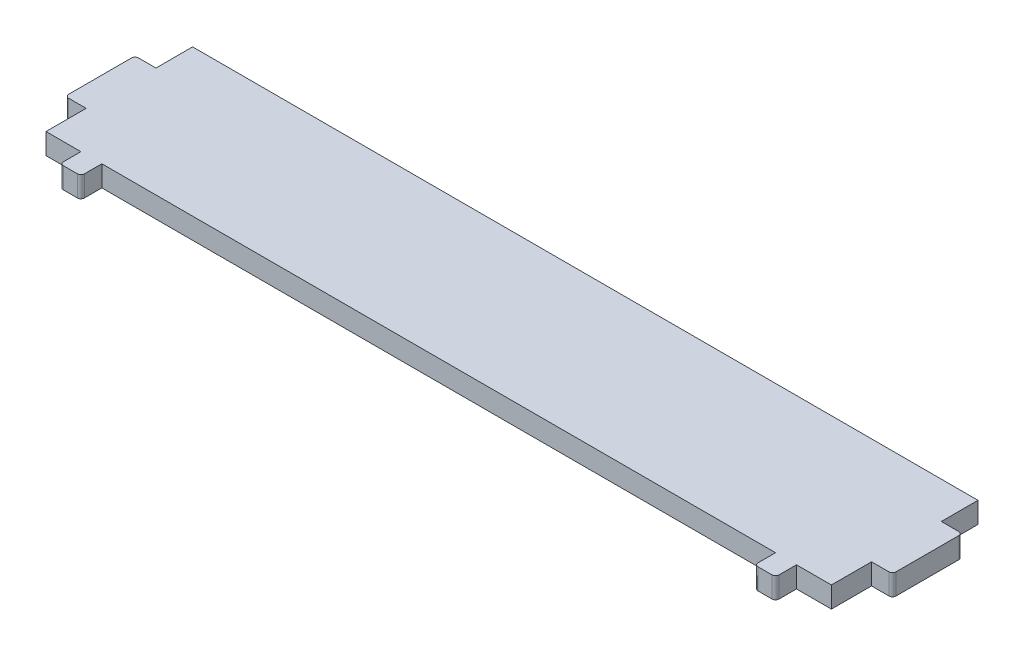
ISO-10303-21;
HEADER;
FILE_DESCRIPTION(('STEP AP214'),'2;1');
FILE_NAME('part.step','',(''),(''),'','','');
FILE_SCHEMA(('AUTOMOTIVE_DESIGN { 1 0 10303 214 1 1 1 1 }'));
ENDSEC;
DATA;
#1=APPLICATION_CONTEXT('core data for automotive mechanical design processes');
#2=APPLICATION_PROTOCOL_DEFINITION('international standard','automotive_design',2000,#1);
#3=PRODUCT_CONTEXT('',#1,'mechanical');
#4=PRODUCT('Part','Part','',(#3));
#5=PRODUCT_RELATED_PRODUCT_CATEGORY('part','',(#4));
#6=PRODUCT_DEFINITION_FORMATION('','',#4);
#7=PRODUCT_DEFINITION_CONTEXT('part definition',#1,'design');
#8=PRODUCT_DEFINITION('design','',#6,#7);
#9=PRODUCT_DEFINITION_SHAPE('','',#8);
#10=(LENGTH_UNIT() NAMED_UNIT(*) SI_UNIT(.MILLI.,.METRE.));
#11=(NAMED_UNIT(*) PLANE_ANGLE_UNIT() SI_UNIT($,.RADIAN.));
#12=(NAMED_UNIT(*) SI_UNIT($,.STERADIAN.) SOLID_ANGLE_UNIT());
#13=UNCERTAINTY_MEASURE_WITH_UNIT(LENGTH_MEASURE(1.E-05),#10,'distance_accuracy_value','');
#14=(GEOMETRIC_REPRESENTATION_CONTEXT(3) GLOBAL_UNCERTAINTY_ASSIGNED_CONTEXT((#13)) GLOBAL_UNIT_ASSIGNED_CONTEXT((#10,
#11,#12)) REPRESENTATION_CONTEXT('',''));
#15=CARTESIAN_POINT('',(0.,0.,0.));
#16=DIRECTION('',(0.,0.,1.));
#17=DIRECTION('',(1.,0.,0.));
#18=AXIS2_PLACEMENT_3D('',#15,#16,#17);
#19=CARTESIAN_POINT('',(-56.25,3.,0.));
#20=DIRECTION('',(-1.,0.,0.));
#21=DIRECTION('',(0.,0.,1.));
#22=AXIS2_PLACEMENT_3D('',#19,#20,#21);
#23=PLANE('',#22);
#24=DIRECTION('',(0.,0.,-1.));
#25=VECTOR('',#24,1.);
#26=CARTESIAN_POINT('',(-56.25,0.,0.));
#27=LINE('',#26,#25);
#28=CARTESIAN_POINT('',(-56.25,0.,21.));
#29=VERTEX_POINT('',#28);
#30=CARTESIAN_POINT('',(-56.25,0.,15.25));
#31=VERTEX_POINT('',#30);
#32=EDGE_CURVE('E232',#29,#31,#27,.T.);
#33=ORIENTED_EDGE('',*,*,#32,.F.);
#34=DIRECTION('',(0.,-1.,0.));
#35=VECTOR('',#34,1.);
#36=CARTESIAN_POINT('',(-56.25,3.,21.));
#37=LINE('',#36,#35);
#38=CARTESIAN_POINT('',(-56.25,3.,21.));
#39=VERTEX_POINT('',#38);
#40=EDGE_CURVE('E227',#39,#29,#37,.T.);
#41=ORIENTED_EDGE('',*,*,#40,.F.);
#42=DIRECTION('',(0.,0.,-1.));
#43=VECTOR('',#42,1.);
#44=CARTESIAN_POINT('',(-56.25,3.,0.));
#45=LINE('',#44,#43);
#46=CARTESIAN_POINT('',(-56.25,3.,15.25));
#47=VERTEX_POINT('',#46);
#48=EDGE_CURVE('E230',#39,#47,#45,.T.);
#49=ORIENTED_EDGE('',*,*,#48,.T.);
#50=DIRECTION('',(0.,-1.,0.));
#51=VECTOR('',#50,1.);
#52=CARTESIAN_POINT('',(-56.25,3.,15.25));
#53=LINE('',#52,#51);
#54=EDGE_CURVE('E292',#47,#31,#53,.T.);
#55=ORIENTED_EDGE('',*,*,#54,.T.);
#56=EDGE_LOOP('',(#33,#41,#49,#55));
#57=FACE_BOUND('',#56,.T.);
#58=ADVANCED_FACE('F41',(#57),#23,.T.);
#59=CARTESIAN_POINT('',(0.,3.,21.));
#60=DIRECTION('',(0.,0.,-1.));
#61=DIRECTION('',(-1.,0.,0.));
#62=AXIS2_PLACEMENT_3D('',#59,#60,#61);
#63=PLANE('',#62);
#64=DIRECTION('',(1.,0.,0.));
#65=VECTOR('',#64,1.);
#66=CARTESIAN_POINT('',(0.,0.,21.));
#67=LINE('',#66,#65);
#68=CARTESIAN_POINT('',(-51.25,0.,21.));
#69=VERTEX_POINT('',#68);
#70=EDGE_CURVE('E294',#29,#69,#67,.T.);
#71=ORIENTED_EDGE('',*,*,#70,.T.);
#72=DIRECTION('',(0.,-1.,0.));
#73=VECTOR('',#72,1.);
#74=CARTESIAN_POINT('',(-51.25,3.,21.));
#75=LINE('',#74,#73);
#76=CARTESIAN_POINT('',(-51.25,3.,21.));
#77=VERTEX_POINT('',#76);
#78=EDGE_CURVE('E237',#77,#69,#75,.T.);
#79=ORIENTED_EDGE('',*,*,#78,.F.);
#80=DIRECTION('',(1.,0.,0.));
#81=VECTOR('',#80,1.);
#82=CARTESIAN_POINT('',(0.,3.,21.));
#83=LINE('',#82,#81);
#84=EDGE_CURVE('E241',#39,#77,#83,.T.);
#85=ORIENTED_EDGE('',*,*,#84,.F.);
#86=ORIENTED_EDGE('',*,*,#40,.T.);
#87=EDGE_LOOP('',(#71,#79,#85,#86));
#88=FACE_BOUND('',#87,.T.);
#89=ADVANCED_FACE('F242',(#88),#63,.F.);
#90=CARTESIAN_POINT('',(-51.25,3.,0.));
#91=DIRECTION('',(-1.,0.,0.));
#92=DIRECTION('',(0.,0.,1.));
#93=AXIS2_PLACEMENT_3D('',#90,#91,#92);
#94=PLANE('',#93);
#95=DIRECTION('',(0.,0.,-1.));
#96=VECTOR('',#95,1.);
#97=CARTESIAN_POINT('',(-51.25,0.,0.));
#98=LINE('',#97,#96);
#99=CARTESIAN_POINT('',(-51.25,0.,23.5));
#100=VERTEX_POINT('',#99);
#101=EDGE_CURVE('E296',#100,#69,#98,.T.);
#102=ORIENTED_EDGE('',*,*,#101,.F.);
#103=DIRECTION('',(0.,-1.,0.));
#104=VECTOR('',#103,1.);
#105=CARTESIAN_POINT('',(-51.25,3.,23.5));
#106=LINE('',#105,#104);
#107=CARTESIAN_POINT('',(-51.25,3.,23.5));
#108=VERTEX_POINT('',#107);
#109=EDGE_CURVE('E382',#100,#108,#106,.F.);
#110=ORIENTED_EDGE('',*,*,#109,.T.);
#111=DIRECTION('',(0.,0.,-1.));
#112=VECTOR('',#111,1.);
#113=CARTESIAN_POINT('',(-51.25,3.,0.));
#114=LINE('',#113,#112);
#115=EDGE_CURVE('E245',#108,#77,#114,.T.);
#116=ORIENTED_EDGE('',*,*,#115,.T.);
#117=ORIENTED_EDGE('',*,*,#78,.T.);
#118=EDGE_LOOP('',(#102,#110,#116,#117));
#119=FACE_BOUND('',#118,.T.);
#120=ADVANCED_FACE('F479',(#119),#94,.T.);
#121=CARTESIAN_POINT('',(0.,3.,24.));
#122=DIRECTION('',(0.,0.,1.));
#123=DIRECTION('',(1.,0.,0.));
#124=AXIS2_PLACEMENT_3D('',#121,#122,#123);
#125=PLANE('',#124);
#126=DIRECTION('',(-1.,0.,0.));
#127=VECTOR('',#126,1.);
#128=CARTESIAN_POINT('',(0.,3.,24.));
#129=LINE('',#128,#127);
#130=CARTESIAN_POINT('',(-48.75,3.,24.));
#131=VERTEX_POINT('',#130);
#132=CARTESIAN_POINT('',(-50.75,3.,24.));
#133=VERTEX_POINT('',#132);
#134=EDGE_CURVE('E258',#131,#133,#129,.T.);
#135=ORIENTED_EDGE('',*,*,#134,.T.);
#136=DIRECTION('',(0.,-1.,0.));
#137=VECTOR('',#136,1.);
#138=CARTESIAN_POINT('',(-50.75,3.,24.));
#139=LINE('',#138,#137);
#140=CARTESIAN_POINT('',(-50.75,0.,24.));
#141=VERTEX_POINT('',#140);
#142=EDGE_CURVE('E363',#133,#141,#139,.T.);
#143=ORIENTED_EDGE('',*,*,#142,.T.);
#144=DIRECTION('',(-1.,0.,0.));
#145=VECTOR('',#144,1.);
#146=CARTESIAN_POINT('',(0.,0.,24.));
#147=LINE('',#146,#145);
#148=CARTESIAN_POINT('',(-48.75,0.,24.));
#149=VERTEX_POINT('',#148);
#150=EDGE_CURVE('E300',#149,#141,#147,.T.);
#151=ORIENTED_EDGE('',*,*,#150,.F.);
#152=DIRECTION('',(0.,-1.,0.));
#153=VECTOR('',#152,1.);
#154=CARTESIAN_POINT('',(-48.75,3.,24.));
#155=LINE('',#154,#153);
#156=EDGE_CURVE('E236',#149,#131,#155,.F.);
#157=ORIENTED_EDGE('',*,*,#156,.T.);
#158=EDGE_LOOP('',(#135,#143,#151,#157));
#159=FACE_BOUND('',#158,.T.);
#160=ADVANCED_FACE('F487',(#159),#125,.T.);
#161=CARTESIAN_POINT('',(-48.25,3.,0.));
#162=DIRECTION('',(-1.,0.,0.));
#163=DIRECTION('',(0.,0.,1.));
#164=AXIS2_PLACEMENT_3D('',#161,#162,#163);
#165=PLANE('',#164);
#166=DIRECTION('',(0.,0.,-1.));
#167=VECTOR('',#166,1.);
#168=CARTESIAN_POINT('',(-48.25,3.,0.));
#169=LINE('',#168,#167);
#170=CARTESIAN_POINT('',(-48.25,3.,23.5));
#171=VERTEX_POINT('',#170);
#172=CARTESIAN_POINT('',(-48.25,3.,21.));
#173=VERTEX_POINT('',#172);
#174=EDGE_CURVE('E261',#171,#173,#169,.T.);
#175=ORIENTED_EDGE('',*,*,#174,.F.);
#176=DIRECTION('',(0.,-1.,0.));
#177=VECTOR('',#176,1.);
#178=CARTESIAN_POINT('',(-48.25,0.,23.5));
#179=LINE('',#178,#177);
#180=CARTESIAN_POINT('',(-48.25,0.,23.5));
#181=VERTEX_POINT('',#180);
#182=EDGE_CURVE('E398',#171,#181,#179,.T.);
#183=ORIENTED_EDGE('',*,*,#182,.T.);
#184=DIRECTION('',(0.,0.,-1.));
#185=VECTOR('',#184,1.);
#186=CARTESIAN_POINT('',(-48.25,0.,0.));
#187=LINE('',#186,#185);
#188=CARTESIAN_POINT('',(-48.25,0.,21.));
#189=VERTEX_POINT('',#188);
#190=EDGE_CURVE('E303',#181,#189,#187,.T.);
#191=ORIENTED_EDGE('',*,*,#190,.T.);
#192=DIRECTION('',(0.,-1.,0.));
#193=VECTOR('',#192,1.);
#194=CARTESIAN_POINT('',(-48.25,3.,21.));
#195=LINE('',#194,#193);
#196=EDGE_CURVE('E358',#173,#189,#195,.T.);
#197=ORIENTED_EDGE('',*,*,#196,.F.);
#198=EDGE_LOOP('',(#175,#183,#191,#197));
#199=FACE_BOUND('',#198,.T.);
#200=ADVANCED_FACE('F497',(#199),#165,.F.);
#201=CARTESIAN_POINT('',(48.25,0.,21.));
#202=VERTEX_POINT('',#201);
#203=EDGE_CURVE('E298',#189,#202,#67,.T.);
#204=ORIENTED_EDGE('',*,*,#203,.T.);
#205=DIRECTION('',(0.,-1.,0.));
#206=VECTOR('',#205,1.);
#207=CARTESIAN_POINT('',(48.25,3.,21.));
#208=LINE('',#207,#206);
#209=CARTESIAN_POINT('',(48.25,3.,21.));
#210=VERTEX_POINT('',#209);
#211=EDGE_CURVE('E355',#210,#202,#208,.T.);
#212=ORIENTED_EDGE('',*,*,#211,.F.);
#213=EDGE_CURVE('E248',#173,#210,#83,.T.);
#214=ORIENTED_EDGE('',*,*,#213,.F.);
#215=ORIENTED_EDGE('',*,*,#196,.T.);
#216=EDGE_LOOP('',(#204,#212,#214,#215));
#217=FACE_BOUND('',#216,.T.);
#218=ADVANCED_FACE('F506',(#217),#63,.F.);
#219=CARTESIAN_POINT('',(48.25,3.,0.));
#220=DIRECTION('',(-1.,0.,0.));
#221=DIRECTION('',(0.,0.,1.));
#222=AXIS2_PLACEMENT_3D('',#219,#220,#221);
#223=PLANE('',#222);
#224=DIRECTION('',(0.,0.,-1.));
#225=VECTOR('',#224,1.);
#226=CARTESIAN_POINT('',(48.25,0.,0.));
#227=LINE('',#226,#225);
#228=CARTESIAN_POINT('',(48.25,0.,23.5));
#229=VERTEX_POINT('',#228);
#230=EDGE_CURVE('E305',#229,#202,#227,.T.);
#231=ORIENTED_EDGE('',*,*,#230,.F.);
#232=DIRECTION('',(0.,-1.,0.));
#233=VECTOR('',#232,1.);
#234=CARTESIAN_POINT('',(48.25,3.,23.5));
#235=LINE('',#234,#233);
#236=CARTESIAN_POINT('',(48.25,3.,23.5));
#237=VERTEX_POINT('',#236);
#238=EDGE_CURVE('E406',#229,#237,#235,.F.);
#239=ORIENTED_EDGE('',*,*,#238,.T.);
#240=DIRECTION('',(0.,0.,-1.));
#241=VECTOR('',#240,1.);
#242=CARTESIAN_POINT('',(48.25,3.,0.));
#243=LINE('',#242,#241);
#244=EDGE_CURVE('E263',#237,#210,#243,.T.);
#245=ORIENTED_EDGE('',*,*,#244,.T.);
#246=ORIENTED_EDGE('',*,*,#211,.T.);
#247=EDGE_LOOP('',(#231,#239,#245,#246));
#248=FACE_BOUND('',#247,.T.);
#249=ADVANCED_FACE('F509',(#248),#223,.T.);
#250=CARTESIAN_POINT('',(0.,3.,24.));
#251=DIRECTION('',(0.,0.,-1.));
#252=DIRECTION('',(-1.,0.,0.));
#253=AXIS2_PLACEMENT_3D('',#250,#251,#252);
#254=PLANE('',#253);
#255=DIRECTION('',(1.,0.,0.));
#256=VECTOR('',#255,1.);
#257=CARTESIAN_POINT('',(0.,3.,24.));
#258=LINE('',#257,#256);
#259=CARTESIAN_POINT('',(48.75,3.,24.));
#260=VERTEX_POINT('',#259);
#261=CARTESIAN_POINT('',(50.75,3.,24.));
#262=VERTEX_POINT('',#261);
#263=EDGE_CURVE('E265',#260,#262,#258,.T.);
#264=ORIENTED_EDGE('',*,*,#263,.F.);
#265=DIRECTION('',(0.,-1.,0.));
#266=VECTOR('',#265,1.);
#267=CARTESIAN_POINT('',(48.75,0.,24.));
#268=LINE('',#267,#266);
#269=CARTESIAN_POINT('',(48.75,0.,24.));
#270=VERTEX_POINT('',#269);
#271=EDGE_CURVE('E403',#260,#270,#268,.T.);
#272=ORIENTED_EDGE('',*,*,#271,.T.);
#273=DIRECTION('',(1.,0.,0.));
#274=VECTOR('',#273,1.);
#275=CARTESIAN_POINT('',(0.,0.,24.));
#276=LINE('',#275,#274);
#277=CARTESIAN_POINT('',(50.75,0.,24.));
#278=VERTEX_POINT('',#277);
#279=EDGE_CURVE('E307',#270,#278,#276,.T.);
#280=ORIENTED_EDGE('',*,*,#279,.T.);
#281=DIRECTION('',(0.,-1.,0.));
#282=VECTOR('',#281,1.);
#283=CARTESIAN_POINT('',(50.75,3.,24.));
#284=LINE('',#283,#282);
#285=EDGE_CURVE('E401',#278,#262,#284,.F.);
#286=ORIENTED_EDGE('',*,*,#285,.T.);
#287=EDGE_LOOP('',(#264,#272,#280,#286));
#288=FACE_BOUND('',#287,.T.);
#289=ADVANCED_FACE('F517',(#288),#254,.F.);
#290=CARTESIAN_POINT('',(51.25,3.,0.));
#291=DIRECTION('',(-1.,0.,0.));
#292=DIRECTION('',(0.,0.,1.));
#293=AXIS2_PLACEMENT_3D('',#290,#291,#292);
#294=PLANE('',#293);
#295=DIRECTION('',(0.,0.,-1.));
#296=VECTOR('',#295,1.);
#297=CARTESIAN_POINT('',(51.25,3.,0.));
#298=LINE('',#297,#296);
#299=CARTESIAN_POINT('',(51.25,3.,23.5));
#300=VERTEX_POINT('',#299);
#301=CARTESIAN_POINT('',(51.25,3.,21.));
#302=VERTEX_POINT('',#301);
#303=EDGE_CURVE('E268',#300,#302,#298,.T.);
#304=ORIENTED_EDGE('',*,*,#303,.F.);
#305=DIRECTION('',(0.,-1.,0.));
#306=VECTOR('',#305,1.);
#307=CARTESIAN_POINT('',(51.25,3.,23.5));
#308=LINE('',#307,#306);
#309=CARTESIAN_POINT('',(51.25,0.,23.5));
#310=VERTEX_POINT('',#309);
#311=EDGE_CURVE('E408',#300,#310,#308,.T.);
#312=ORIENTED_EDGE('',*,*,#311,.T.);
#313=DIRECTION('',(0.,0.,-1.));
#314=VECTOR('',#313,1.);
#315=CARTESIAN_POINT('',(51.25,0.,0.));
#316=LINE('',#315,#314);
#317=CARTESIAN_POINT('',(51.25,0.,21.));
#318=VERTEX_POINT('',#317);
#319=EDGE_CURVE('E310',#310,#318,#316,.T.);
#320=ORIENTED_EDGE('',*,*,#319,.T.);
#321=DIRECTION('',(0.,-1.,0.));
#322=VECTOR('',#321,1.);
#323=CARTESIAN_POINT('',(51.25,3.,21.));
#324=LINE('',#323,#322);
#325=EDGE_CURVE('E352',#302,#318,#324,.T.);
#326=ORIENTED_EDGE('',*,*,#325,.F.);
#327=EDGE_LOOP('',(#304,#312,#320,#326));
#328=FACE_BOUND('',#327,.T.);
#329=ADVANCED_FACE('F526',(#328),#294,.F.);
#330=CARTESIAN_POINT('',(56.25,0.,21.));
#331=VERTEX_POINT('',#330);
#332=EDGE_CURVE('E297',#318,#331,#67,.T.);
#333=ORIENTED_EDGE('',*,*,#332,.T.);
#334=DIRECTION('',(0.,-1.,0.));
#335=VECTOR('',#334,1.);
#336=CARTESIAN_POINT('',(56.25,3.,21.));
#337=LINE('',#336,#335);
#338=CARTESIAN_POINT('',(56.25,3.,21.));
#339=VERTEX_POINT('',#338);
#340=EDGE_CURVE('E349',#339,#331,#337,.T.);
#341=ORIENTED_EDGE('',*,*,#340,.F.);
#342=EDGE_CURVE('E247',#302,#339,#83,.T.);
#343=ORIENTED_EDGE('',*,*,#342,.F.);
#344=ORIENTED_EDGE('',*,*,#325,.T.);
#345=EDGE_LOOP('',(#333,#341,#343,#344));
#346=FACE_BOUND('',#345,.T.);
#347=ADVANCED_FACE('F532',(#346),#63,.F.);
#348=CARTESIAN_POINT('',(56.25,3.,0.));
#349=DIRECTION('',(-1.,0.,0.));
#350=DIRECTION('',(0.,0.,1.));
#351=AXIS2_PLACEMENT_3D('',#348,#349,#350);
#352=PLANE('',#351);
#353=DIRECTION('',(0.,0.,-1.));
#354=VECTOR('',#353,1.);
#355=CARTESIAN_POINT('',(56.25,0.,0.));
#356=LINE('',#355,#354);
#357=CARTESIAN_POINT('',(56.25,0.,15.25));
#358=VERTEX_POINT('',#357);
#359=EDGE_CURVE('E312',#331,#358,#356,.T.);
#360=ORIENTED_EDGE('',*,*,#359,.T.);
#361=DIRECTION('',(0.,-1.,0.));
#362=VECTOR('',#361,1.);
#363=CARTESIAN_POINT('',(56.25,3.,15.25));
#364=LINE('',#363,#362);
#365=CARTESIAN_POINT('',(56.25,3.,15.25));
#366=VERTEX_POINT('',#365);
#367=EDGE_CURVE('E346',#366,#358,#364,.T.);
#368=ORIENTED_EDGE('',*,*,#367,.F.);
#369=DIRECTION('',(0.,0.,-1.));
#370=VECTOR('',#369,1.);
#371=CARTESIAN_POINT('',(56.25,3.,0.));
#372=LINE('',#371,#370);
#373=EDGE_CURVE('E270',#339,#366,#372,.T.);
#374=ORIENTED_EDGE('',*,*,#373,.F.);
#375=ORIENTED_EDGE('',*,*,#340,.T.);
#376=EDGE_LOOP('',(#360,#368,#374,#375));
#377=FACE_BOUND('',#376,.T.);
#378=ADVANCED_FACE('F537',(#377),#352,.F.);
#379=CARTESIAN_POINT('',(0.,3.,15.25));
#380=DIRECTION('',(0.,0.,-1.));
#381=DIRECTION('',(-1.,0.,0.));
#382=AXIS2_PLACEMENT_3D('',#379,#380,#381);
#383=PLANE('',#382);
#384=DIRECTION('',(1.,0.,0.));
#385=VECTOR('',#384,1.);
#386=CARTESIAN_POINT('',(0.,0.,15.25));
#387=LINE('',#386,#385);
#388=CARTESIAN_POINT('',(58.75,0.,15.25));
#389=VERTEX_POINT('',#388);
#390=EDGE_CURVE('E314',#358,#389,#387,.T.);
#391=ORIENTED_EDGE('',*,*,#390,.T.);
#392=DIRECTION('',(0.,-1.,0.));
#393=VECTOR('',#392,1.);
#394=CARTESIAN_POINT('',(58.75,3.,15.25));
#395=LINE('',#394,#393);
#396=CARTESIAN_POINT('',(58.75,3.,15.25));
#397=VERTEX_POINT('',#396);
#398=EDGE_CURVE('E11',#389,#397,#395,.F.);
#399=ORIENTED_EDGE('',*,*,#398,.T.);
#400=DIRECTION('',(1.,0.,0.));
#401=VECTOR('',#400,1.);
#402=CARTESIAN_POINT('',(0.,3.,15.25));
#403=LINE('',#402,#401);
#404=EDGE_CURVE('E272',#366,#397,#403,.T.);
#405=ORIENTED_EDGE('',*,*,#404,.F.);
#406=ORIENTED_EDGE('',*,*,#367,.T.);
#407=EDGE_LOOP('',(#391,#399,#405,#406));
#408=FACE_BOUND('',#407,.T.);
#409=ADVANCED_FACE('F541',(#408),#383,.F.);
#410=CARTESIAN_POINT('',(59.25,3.,0.));
#411=DIRECTION('',(-1.,0.,0.));
#412=DIRECTION('',(0.,0.,1.));
#413=AXIS2_PLACEMENT_3D('',#410,#411,#412);
#414=PLANE('',#413);
#415=DIRECTION('',(0.,0.,-1.));
#416=VECTOR('',#415,1.);
#417=CARTESIAN_POINT('',(59.25,0.,0.));
#418=LINE('',#417,#416);
#419=CARTESIAN_POINT('',(59.25,0.,14.75));
#420=VERTEX_POINT('',#419);
#421=CARTESIAN_POINT('',(59.25,0.,5.75000000000001));
#422=VERTEX_POINT('',#421);
#423=EDGE_CURVE('E317',#420,#422,#418,.T.);
#424=ORIENTED_EDGE('',*,*,#423,.T.);
#425=DIRECTION('',(0.,-1.,0.));
#426=VECTOR('',#425,1.);
#427=CARTESIAN_POINT('',(59.25,3.,5.75000000000001));
#428=LINE('',#427,#426);
#429=CARTESIAN_POINT('',(59.25,3.,5.75000000000001));
#430=VERTEX_POINT('',#429);
#431=EDGE_CURVE('E49',#422,#430,#428,.F.);
#432=ORIENTED_EDGE('',*,*,#431,.T.);
#433=DIRECTION('',(0.,0.,-1.));
#434=VECTOR('',#433,1.);
#435=CARTESIAN_POINT('',(59.25,3.,0.));
#436=LINE('',#435,#434);
#437=CARTESIAN_POINT('',(59.25,3.,14.75));
#438=VERTEX_POINT('',#437);
#439=EDGE_CURVE('E275',#438,#430,#436,.T.);
#440=ORIENTED_EDGE('',*,*,#439,.F.);
#441=DIRECTION('',(0.,-1.,0.));
#442=VECTOR('',#441,1.);
#443=CARTESIAN_POINT('',(59.25,3.,14.75));
#444=LINE('',#443,#442);
#445=EDGE_CURVE('E424',#438,#420,#444,.T.);
#446=ORIENTED_EDGE('',*,*,#445,.T.);
#447=EDGE_LOOP('',(#424,#432,#440,#446));
#448=FACE_BOUND('',#447,.T.);
#449=ADVANCED_FACE('F429',(#448),#414,.F.);
#450=CARTESIAN_POINT('',(0.,3.,5.25000000000003));
#451=DIRECTION('',(0.,0.,1.));
#452=DIRECTION('',(1.,0.,0.));
#453=AXIS2_PLACEMENT_3D('',#450,#451,#452);
#454=PLANE('',#453);
#455=DIRECTION('',(-1.,0.,0.));
#456=VECTOR('',#455,1.);
#457=CARTESIAN_POINT('',(0.,3.,5.25000000000003));
#458=LINE('',#457,#456);
#459=CARTESIAN_POINT('',(58.75,3.,5.25000000000001));
#460=VERTEX_POINT('',#459);
#461=CARTESIAN_POINT('',(56.25,3.,5.25000000000002));
#462=VERTEX_POINT('',#461);
#463=EDGE_CURVE('E278',#460,#462,#458,.T.);
#464=ORIENTED_EDGE('',*,*,#463,.F.);
#465=DIRECTION('',(0.,-1.,0.));
#466=VECTOR('',#465,1.);
#467=CARTESIAN_POINT('',(58.75,3.,5.25000000000001));
#468=LINE('',#467,#466);
#469=CARTESIAN_POINT('',(58.75,0.,5.25000000000001));
#470=VERTEX_POINT('',#469);
#471=EDGE_CURVE('E421',#460,#470,#468,.T.);
#472=ORIENTED_EDGE('',*,*,#471,.T.);
#473=DIRECTION('',(-1.,0.,0.));
#474=VECTOR('',#473,1.);
#475=CARTESIAN_POINT('',(0.,0.,5.25000000000003));
#476=LINE('',#475,#474);
#477=CARTESIAN_POINT('',(56.25,0.,5.25000000000002));
#478=VERTEX_POINT('',#477);
#479=EDGE_CURVE('E320',#470,#478,#476,.T.);
#480=ORIENTED_EDGE('',*,*,#479,.T.);
#481=DIRECTION('',(0.,-1.,0.));
#482=VECTOR('',#481,1.);
#483=CARTESIAN_POINT('',(56.25,3.,5.25000000000002));
#484=LINE('',#483,#482);
#485=EDGE_CURVE('E343',#462,#478,#484,.T.);
#486=ORIENTED_EDGE('',*,*,#485,.F.);
#487=EDGE_LOOP('',(#464,#472,#480,#486));
#488=FACE_BOUND('',#487,.T.);
#489=ADVANCED_FACE('F440',(#488),#454,.F.);
#490=CARTESIAN_POINT('',(56.25,3.,0.));
#491=DIRECTION('',(-1.,0.,0.));
#492=DIRECTION('',(0.,0.,1.));
#493=AXIS2_PLACEMENT_3D('',#490,#491,#492);
#494=PLANE('',#493);
#495=DIRECTION('',(0.,0.,-1.));
#496=VECTOR('',#495,1.);
#497=CARTESIAN_POINT('',(56.25,0.,0.));
#498=LINE('',#497,#496);
#499=CARTESIAN_POINT('',(56.25,0.,0.));
#500=VERTEX_POINT('',#499);
#501=EDGE_CURVE('E322',#478,#500,#498,.T.);
#502=ORIENTED_EDGE('',*,*,#501,.T.);
#503=DIRECTION('',(0.,-1.,0.));
#504=VECTOR('',#503,1.);
#505=CARTESIAN_POINT('',(56.25,3.,0.));
#506=LINE('',#505,#504);
#507=CARTESIAN_POINT('',(56.25,3.,0.));
#508=VERTEX_POINT('',#507);
#509=EDGE_CURVE('E340',#508,#500,#506,.T.);
#510=ORIENTED_EDGE('',*,*,#509,.F.);
#511=DIRECTION('',(0.,0.,-1.));
#512=VECTOR('',#511,1.);
#513=CARTESIAN_POINT('',(56.25,3.,0.));
#514=LINE('',#513,#512);
#515=EDGE_CURVE('E280',#462,#508,#514,.T.);
#516=ORIENTED_EDGE('',*,*,#515,.F.);
#517=ORIENTED_EDGE('',*,*,#485,.T.);
#518=EDGE_LOOP('',(#502,#510,#516,#517));
#519=FACE_BOUND('',#518,.T.);
#520=ADVANCED_FACE('F448',(#519),#494,.F.);
#521=CARTESIAN_POINT('',(0.,3.,0.));
#522=DIRECTION('',(0.,0.,1.));
#523=DIRECTION('',(1.,0.,0.));
#524=AXIS2_PLACEMENT_3D('',#521,#522,#523);
#525=PLANE('',#524);
#526=DIRECTION('',(-1.,0.,0.));
#527=VECTOR('',#526,1.);
#528=CARTESIAN_POINT('',(0.,0.,0.));
#529=LINE('',#528,#527);
#530=CARTESIAN_POINT('',(-56.25,0.,0.));
#531=VERTEX_POINT('',#530);
#532=EDGE_CURVE('E324',#500,#531,#529,.T.);
#533=ORIENTED_EDGE('',*,*,#532,.T.);
#534=DIRECTION('',(0.,-1.,0.));
#535=VECTOR('',#534,1.);
#536=CARTESIAN_POINT('',(-56.25,3.,0.));
#537=LINE('',#536,#535);
#538=CARTESIAN_POINT('',(-56.25,3.,0.));
#539=VERTEX_POINT('',#538);
#540=EDGE_CURVE('E338',#539,#531,#537,.T.);
#541=ORIENTED_EDGE('',*,*,#540,.F.);
#542=DIRECTION('',(-1.,0.,0.));
#543=VECTOR('',#542,1.);
#544=CARTESIAN_POINT('',(0.,3.,0.));
#545=LINE('',#544,#543);
#546=EDGE_CURVE('E282',#508,#539,#545,.T.);
#547=ORIENTED_EDGE('',*,*,#546,.F.);
#548=ORIENTED_EDGE('',*,*,#509,.T.);
#549=EDGE_LOOP('',(#533,#541,#547,#548));
#550=FACE_BOUND('',#549,.T.);
#551=ADVANCED_FACE('F452',(#550),#525,.F.);
#552=CARTESIAN_POINT('',(-56.25,3.,0.));
#553=DIRECTION('',(-1.,0.,0.));
#554=DIRECTION('',(0.,0.,1.));
#555=AXIS2_PLACEMENT_3D('',#552,#553,#554);
#556=PLANE('',#555);
#557=DIRECTION('',(0.,0.,-1.));
#558=VECTOR('',#557,1.);
#559=CARTESIAN_POINT('',(-56.25,0.,0.));
#560=LINE('',#559,#558);
#561=CARTESIAN_POINT('',(-56.25,0.,5.25000000000002));
#562=VERTEX_POINT('',#561);
#563=EDGE_CURVE('E327',#562,#531,#560,.T.);
#564=ORIENTED_EDGE('',*,*,#563,.F.);
#565=DIRECTION('',(0.,-1.,0.));
#566=VECTOR('',#565,1.);
#567=CARTESIAN_POINT('',(-56.25,3.,5.25000000000002));
#568=LINE('',#567,#566);
#569=CARTESIAN_POINT('',(-56.25,3.,5.25000000000002));
#570=VERTEX_POINT('',#569);
#571=EDGE_CURVE('E335',#570,#562,#568,.T.);
#572=ORIENTED_EDGE('',*,*,#571,.F.);
#573=DIRECTION('',(0.,0.,-1.));
#574=VECTOR('',#573,1.);
#575=CARTESIAN_POINT('',(-56.25,3.,0.));
#576=LINE('',#575,#574);
#577=EDGE_CURVE('E284',#570,#539,#576,.T.);
#578=ORIENTED_EDGE('',*,*,#577,.T.);
#579=ORIENTED_EDGE('',*,*,#540,.T.);
#580=EDGE_LOOP('',(#564,#572,#578,#579));
#581=FACE_BOUND('',#580,.T.);
#582=ADVANCED_FACE('F458',(#581),#556,.T.);
#583=CARTESIAN_POINT('',(0.,3.,5.25000000000003));
#584=DIRECTION('',(0.,0.,-1.));
#585=DIRECTION('',(-1.,0.,0.));
#586=AXIS2_PLACEMENT_3D('',#583,#584,#585);
#587=PLANE('',#586);
#588=DIRECTION('',(1.,0.,0.));
#589=VECTOR('',#588,1.);
#590=CARTESIAN_POINT('',(0.,0.,5.25000000000003));
#591=LINE('',#590,#589);
#592=CARTESIAN_POINT('',(-58.75,0.,5.25000000000001));
#593=VERTEX_POINT('',#592);
#594=EDGE_CURVE('E330',#593,#562,#591,.T.);
#595=ORIENTED_EDGE('',*,*,#594,.F.);
#596=DIRECTION('',(0.,-1.,0.));
#597=VECTOR('',#596,1.);
#598=CARTESIAN_POINT('',(-58.75,3.,5.25000000000001));
#599=LINE('',#598,#597);
#600=CARTESIAN_POINT('',(-58.75,3.,5.25000000000001));
#601=VERTEX_POINT('',#600);
#602=EDGE_CURVE('E416',#593,#601,#599,.F.);
#603=ORIENTED_EDGE('',*,*,#602,.T.);
#604=DIRECTION('',(1.,0.,0.));
#605=VECTOR('',#604,1.);
#606=CARTESIAN_POINT('',(0.,3.,5.25000000000003));
#607=LINE('',#606,#605);
#608=EDGE_CURVE('E287',#601,#570,#607,.T.);
#609=ORIENTED_EDGE('',*,*,#608,.T.);
#610=ORIENTED_EDGE('',*,*,#571,.T.);
#611=EDGE_LOOP('',(#595,#603,#609,#610));
#612=FACE_BOUND('',#611,.T.);
#613=ADVANCED_FACE('F461',(#612),#587,.T.);
#614=CARTESIAN_POINT('',(-59.25,3.,0.));
#615=DIRECTION('',(-1.,0.,0.));
#616=DIRECTION('',(0.,0.,1.));
#617=AXIS2_PLACEMENT_3D('',#614,#615,#616);
#618=PLANE('',#617);
#619=DIRECTION('',(0.,0.,-1.));
#620=VECTOR('',#619,1.);
#621=CARTESIAN_POINT('',(-59.25,3.,0.));
#622=LINE('',#621,#620);
#623=CARTESIAN_POINT('',(-59.25,3.,14.75));
#624=VERTEX_POINT('',#623);
#625=CARTESIAN_POINT('',(-59.25,3.,5.75000000000001));
#626=VERTEX_POINT('',#625);
#627=EDGE_CURVE('E289',#624,#626,#622,.T.);
#628=ORIENTED_EDGE('',*,*,#627,.T.);
#629=DIRECTION('',(0.,-1.,0.));
#630=VECTOR('',#629,1.);
#631=CARTESIAN_POINT('',(-59.25,3.,5.75000000000001));
#632=LINE('',#631,#630);
#633=CARTESIAN_POINT('',(-59.25,0.,5.75000000000001));
#634=VERTEX_POINT('',#633);
#635=EDGE_CURVE('E413',#626,#634,#632,.T.);
#636=ORIENTED_EDGE('',*,*,#635,.T.);
#637=DIRECTION('',(0.,0.,-1.));
#638=VECTOR('',#637,1.);
#639=CARTESIAN_POINT('',(-59.25,0.,0.));
#640=LINE('',#639,#638);
#641=CARTESIAN_POINT('',(-59.25,0.,14.75));
#642=VERTEX_POINT('',#641);
#643=EDGE_CURVE('E254',#642,#634,#640,.T.);
#644=ORIENTED_EDGE('',*,*,#643,.F.);
#645=DIRECTION('',(0.,-1.,0.));
#646=VECTOR('',#645,1.);
#647=CARTESIAN_POINT('',(-59.25,3.,14.75));
#648=LINE('',#647,#646);
#649=EDGE_CURVE('E411',#642,#624,#648,.F.);
#650=ORIENTED_EDGE('',*,*,#649,.T.);
#651=EDGE_LOOP('',(#628,#636,#644,#650));
#652=FACE_BOUND('',#651,.T.);
#653=ADVANCED_FACE('F468',(#652),#618,.T.);
#654=CARTESIAN_POINT('',(0.,3.,15.25));
#655=DIRECTION('',(0.,0.,1.));
#656=DIRECTION('',(1.,0.,0.));
#657=AXIS2_PLACEMENT_3D('',#654,#655,#656);
#658=PLANE('',#657);
#659=DIRECTION('',(-1.,0.,0.));
#660=VECTOR('',#659,1.);
#661=CARTESIAN_POINT('',(0.,3.,15.25));
#662=LINE('',#661,#660);
#663=CARTESIAN_POINT('',(-58.75,3.,15.25));
#664=VERTEX_POINT('',#663);
#665=EDGE_CURVE('E250',#47,#664,#662,.T.);
#666=ORIENTED_EDGE('',*,*,#665,.T.);
#667=DIRECTION('',(0.,-1.,0.));
#668=VECTOR('',#667,1.);
#669=CARTESIAN_POINT('',(-58.75,3.,15.25));
#670=LINE('',#669,#668);
#671=CARTESIAN_POINT('',(-58.75,0.,15.25));
#672=VERTEX_POINT('',#671);
#673=EDGE_CURVE('E418',#664,#672,#670,.T.);
#674=ORIENTED_EDGE('',*,*,#673,.T.);
#675=DIRECTION('',(-1.,0.,0.));
#676=VECTOR('',#675,1.);
#677=CARTESIAN_POINT('',(0.,0.,15.25));
#678=LINE('',#677,#676);
#679=EDGE_CURVE('E251',#31,#672,#678,.T.);
#680=ORIENTED_EDGE('',*,*,#679,.F.);
#681=ORIENTED_EDGE('',*,*,#54,.F.);
#682=EDGE_LOOP('',(#666,#674,#680,#681));
#683=FACE_BOUND('',#682,.T.);
#684=ADVANCED_FACE('F475',(#683),#658,.T.);
#685=CARTESIAN_POINT('',(0.,3.,0.));
#686=DIRECTION('',(0.,1.,0.));
#687=DIRECTION('',(0.,0.,1.));
#688=AXIS2_PLACEMENT_3D('',#685,#686,#687);
#689=PLANE('',#688);
#690=ORIENTED_EDGE('',*,*,#115,.F.);
#691=CARTESIAN_POINT('',(-50.75,3.,23.5));
#692=DIRECTION('',(0.,1.,0.));
#693=DIRECTION('',(0.,0.,1.));
#694=AXIS2_PLACEMENT_3D('',#691,#692,#693);
#695=CIRCLE('',#694,0.5);
#696=EDGE_CURVE('E396',#108,#133,#695,.T.);
#697=ORIENTED_EDGE('',*,*,#696,.T.);
#698=ORIENTED_EDGE('',*,*,#134,.F.);
#699=CARTESIAN_POINT('',(-48.75,3.,23.5));
#700=DIRECTION('',(0.,1.,0.));
#701=DIRECTION('',(0.,0.,1.));
#702=AXIS2_PLACEMENT_3D('',#699,#700,#701);
#703=CIRCLE('',#702,0.5);
#704=EDGE_CURVE('E394',#131,#171,#703,.T.);
#705=ORIENTED_EDGE('',*,*,#704,.T.);
#706=ORIENTED_EDGE('',*,*,#174,.T.);
#707=ORIENTED_EDGE('',*,*,#213,.T.);
#708=ORIENTED_EDGE('',*,*,#244,.F.);
#709=CARTESIAN_POINT('',(48.75,3.,23.5));
#710=DIRECTION('',(0.,1.,0.));
#711=DIRECTION('',(0.,0.,1.));
#712=AXIS2_PLACEMENT_3D('',#709,#710,#711);
#713=CIRCLE('',#712,0.5);
#714=EDGE_CURVE('E392',#237,#260,#713,.T.);
#715=ORIENTED_EDGE('',*,*,#714,.T.);
#716=ORIENTED_EDGE('',*,*,#263,.T.);
#717=CARTESIAN_POINT('',(50.75,3.,23.5));
#718=DIRECTION('',(0.,1.,0.));
#719=DIRECTION('',(0.,0.,1.));
#720=AXIS2_PLACEMENT_3D('',#717,#718,#719);
#721=CIRCLE('',#720,0.5);
#722=EDGE_CURVE('E390',#262,#300,#721,.T.);
#723=ORIENTED_EDGE('',*,*,#722,.T.);
#724=ORIENTED_EDGE('',*,*,#303,.T.);
#725=ORIENTED_EDGE('',*,*,#342,.T.);
#726=ORIENTED_EDGE('',*,*,#373,.T.);
#727=ORIENTED_EDGE('',*,*,#404,.T.);
#728=CARTESIAN_POINT('',(58.75,3.,14.75));
#729=DIRECTION('',(0.,1.,0.));
#730=DIRECTION('',(0.,0.,1.));
#731=AXIS2_PLACEMENT_3D('',#728,#729,#730);
#732=CIRCLE('',#731,0.5);
#733=EDGE_CURVE('E384',#397,#438,#732,.T.);
#734=ORIENTED_EDGE('',*,*,#733,.T.);
#735=ORIENTED_EDGE('',*,*,#439,.T.);
#736=CARTESIAN_POINT('',(58.75,3.,5.75000000000001));
#737=DIRECTION('',(0.,1.,0.));
#738=DIRECTION('',(0.,0.,1.));
#739=AXIS2_PLACEMENT_3D('',#736,#737,#738);
#740=CIRCLE('',#739,0.5);
#741=EDGE_CURVE('E386',#430,#460,#740,.T.);
#742=ORIENTED_EDGE('',*,*,#741,.T.);
#743=ORIENTED_EDGE('',*,*,#463,.T.);
#744=ORIENTED_EDGE('',*,*,#515,.T.);
#745=ORIENTED_EDGE('',*,*,#546,.T.);
#746=ORIENTED_EDGE('',*,*,#577,.F.);
#747=ORIENTED_EDGE('',*,*,#608,.F.);
#748=CARTESIAN_POINT('',(-58.75,3.,5.75000000000001));
#749=DIRECTION('',(0.,1.,0.));
#750=DIRECTION('',(0.,0.,1.));
#751=AXIS2_PLACEMENT_3D('',#748,#749,#750);
#752=CIRCLE('',#751,0.5);
#753=EDGE_CURVE('E62',#601,#626,#752,.T.);
#754=ORIENTED_EDGE('',*,*,#753,.T.);
#755=ORIENTED_EDGE('',*,*,#627,.F.);
#756=CARTESIAN_POINT('',(-58.75,3.,14.75));
#757=DIRECTION('',(0.,1.,0.));
#758=DIRECTION('',(0.,0.,1.));
#759=AXIS2_PLACEMENT_3D('',#756,#757,#758);
#760=CIRCLE('',#759,0.5);
#761=EDGE_CURVE('E56',#624,#664,#760,.T.);
#762=ORIENTED_EDGE('',*,*,#761,.T.);
#763=ORIENTED_EDGE('',*,*,#665,.F.);
#764=ORIENTED_EDGE('',*,*,#48,.F.);
#765=ORIENTED_EDGE('',*,*,#84,.T.);
#766=EDGE_LOOP('',(#690,#697,#698,#705,#706,#707,#708,#715,#716,#723,#724,#725,#726,#727,#734,
#735,#742,#743,#744,#745,#746,#747,#754,#755,#762,#763,#764,#765));
#767=FACE_BOUND('',#766,.T.);
#768=ADVANCED_FACE('F249',(#767),#689,.T.);
#769=CARTESIAN_POINT('',(0.,0.,0.));
#770=DIRECTION('',(0.,1.,0.));
#771=DIRECTION('',(0.,0.,1.));
#772=AXIS2_PLACEMENT_3D('',#769,#770,#771);
#773=PLANE('',#772);
#774=ORIENTED_EDGE('',*,*,#150,.T.);
#775=CARTESIAN_POINT('',(-50.75,0.,23.5));
#776=DIRECTION('',(0.,1.,0.));
#777=DIRECTION('',(0.,0.,1.));
#778=AXIS2_PLACEMENT_3D('',#775,#776,#777);
#779=CIRCLE('',#778,0.5);
#780=EDGE_CURVE('E380',#141,#100,#779,.F.);
#781=ORIENTED_EDGE('',*,*,#780,.T.);
#782=ORIENTED_EDGE('',*,*,#101,.T.);
#783=ORIENTED_EDGE('',*,*,#70,.F.);
#784=ORIENTED_EDGE('',*,*,#32,.T.);
#785=ORIENTED_EDGE('',*,*,#679,.T.);
#786=CARTESIAN_POINT('',(-58.75,0.,14.75));
#787=DIRECTION('',(0.,1.,0.));
#788=DIRECTION('',(0.,0.,1.));
#789=AXIS2_PLACEMENT_3D('',#786,#787,#788);
#790=CIRCLE('',#789,0.5);
#791=EDGE_CURVE('E370',#672,#642,#790,.F.);
#792=ORIENTED_EDGE('',*,*,#791,.T.);
#793=ORIENTED_EDGE('',*,*,#643,.T.);
#794=CARTESIAN_POINT('',(-58.75,0.,5.75000000000001));
#795=DIRECTION('',(0.,1.,0.));
#796=DIRECTION('',(0.,0.,1.));
#797=AXIS2_PLACEMENT_3D('',#794,#795,#796);
#798=CIRCLE('',#797,0.5);
#799=EDGE_CURVE('E372',#634,#593,#798,.F.);
#800=ORIENTED_EDGE('',*,*,#799,.T.);
#801=ORIENTED_EDGE('',*,*,#594,.T.);
#802=ORIENTED_EDGE('',*,*,#563,.T.);
#803=ORIENTED_EDGE('',*,*,#532,.F.);
#804=ORIENTED_EDGE('',*,*,#501,.F.);
#805=ORIENTED_EDGE('',*,*,#479,.F.);
#806=CARTESIAN_POINT('',(58.75,0.,5.75000000000001));
#807=DIRECTION('',(0.,1.,0.));
#808=DIRECTION('',(0.,0.,1.));
#809=AXIS2_PLACEMENT_3D('',#806,#807,#808);
#810=CIRCLE('',#809,0.5);
#811=EDGE_CURVE('E368',#470,#422,#810,.F.);
#812=ORIENTED_EDGE('',*,*,#811,.T.);
#813=ORIENTED_EDGE('',*,*,#423,.F.);
#814=CARTESIAN_POINT('',(58.75,0.,14.75));
#815=DIRECTION('',(0.,1.,0.));
#816=DIRECTION('',(0.,0.,1.));
#817=AXIS2_PLACEMENT_3D('',#814,#815,#816);
#818=CIRCLE('',#817,0.5);
#819=EDGE_CURVE('E366',#420,#389,#818,.F.);
#820=ORIENTED_EDGE('',*,*,#819,.T.);
#821=ORIENTED_EDGE('',*,*,#390,.F.);
#822=ORIENTED_EDGE('',*,*,#359,.F.);
#823=ORIENTED_EDGE('',*,*,#332,.F.);
#824=ORIENTED_EDGE('',*,*,#319,.F.);
#825=CARTESIAN_POINT('',(50.75,0.,23.5));
#826=DIRECTION('',(0.,1.,0.));
#827=DIRECTION('',(0.,0.,1.));
#828=AXIS2_PLACEMENT_3D('',#825,#826,#827);
#829=CIRCLE('',#828,0.5);
#830=EDGE_CURVE('E374',#310,#278,#829,.F.);
#831=ORIENTED_EDGE('',*,*,#830,.T.);
#832=ORIENTED_EDGE('',*,*,#279,.F.);
#833=CARTESIAN_POINT('',(48.75,0.,23.5));
#834=DIRECTION('',(0.,1.,0.));
#835=DIRECTION('',(0.,0.,1.));
#836=AXIS2_PLACEMENT_3D('',#833,#834,#835);
#837=CIRCLE('',#836,0.5);
#838=EDGE_CURVE('E376',#270,#229,#837,.F.);
#839=ORIENTED_EDGE('',*,*,#838,.T.);
#840=ORIENTED_EDGE('',*,*,#230,.T.);
#841=ORIENTED_EDGE('',*,*,#203,.F.);
#842=ORIENTED_EDGE('',*,*,#190,.F.);
#843=CARTESIAN_POINT('',(-48.75,0.,23.5));
#844=DIRECTION('',(0.,1.,0.));
#845=DIRECTION('',(0.,0.,1.));
#846=AXIS2_PLACEMENT_3D('',#843,#844,#845);
#847=CIRCLE('',#846,0.5);
#848=EDGE_CURVE('E378',#181,#149,#847,.F.);
#849=ORIENTED_EDGE('',*,*,#848,.T.);
#850=EDGE_LOOP('',(#774,#781,#782,#783,#784,#785,#792,#793,#800,#801,#802,#803,#804,#805,#812,
#813,#820,#821,#822,#823,#824,#831,#832,#839,#840,#841,#842,#849));
#851=FACE_BOUND('',#850,.T.);
#852=ADVANCED_FACE('F444',(#851),#773,.F.);
#853=CARTESIAN_POINT('',(-50.75,3.,23.5));
#854=DIRECTION('',(0.,-1.,0.));
#855=DIRECTION('',(0.,0.,-1.));
#856=AXIS2_PLACEMENT_3D('',#853,#854,#855);
#857=CYLINDRICAL_SURFACE('',#856,0.5);
#858=ORIENTED_EDGE('',*,*,#696,.F.);
#859=ORIENTED_EDGE('',*,*,#109,.F.);
#860=ORIENTED_EDGE('',*,*,#780,.F.);
#861=ORIENTED_EDGE('',*,*,#142,.F.);
#862=EDGE_LOOP('',(#858,#859,#860,#861));
#863=FACE_BOUND('',#862,.T.);
#864=ADVANCED_FACE('F484',(#863),#857,.T.);
#865=CARTESIAN_POINT('',(-48.75,3.,23.5));
#866=DIRECTION('',(0.,1.,0.));
#867=DIRECTION('',(0.,0.,1.));
#868=AXIS2_PLACEMENT_3D('',#865,#866,#867);
#869=CYLINDRICAL_SURFACE('',#868,0.5);
#870=ORIENTED_EDGE('',*,*,#704,.F.);
#871=ORIENTED_EDGE('',*,*,#156,.F.);
#872=ORIENTED_EDGE('',*,*,#848,.F.);
#873=ORIENTED_EDGE('',*,*,#182,.F.);
#874=EDGE_LOOP('',(#870,#871,#872,#873));
#875=FACE_BOUND('',#874,.T.);
#876=ADVANCED_FACE('F494',(#875),#869,.T.);
#877=CARTESIAN_POINT('',(48.75,3.,23.5));
#878=DIRECTION('',(0.,1.,0.));
#879=DIRECTION('',(0.,0.,1.));
#880=AXIS2_PLACEMENT_3D('',#877,#878,#879);
#881=CYLINDRICAL_SURFACE('',#880,0.5);
#882=ORIENTED_EDGE('',*,*,#714,.F.);
#883=ORIENTED_EDGE('',*,*,#238,.F.);
#884=ORIENTED_EDGE('',*,*,#838,.F.);
#885=ORIENTED_EDGE('',*,*,#271,.F.);
#886=EDGE_LOOP('',(#882,#883,#884,#885));
#887=FACE_BOUND('',#886,.T.);
#888=ADVANCED_FACE('F512',(#887),#881,.T.);
#889=CARTESIAN_POINT('',(50.75,3.,23.5));
#890=DIRECTION('',(0.,-1.,0.));
#891=DIRECTION('',(0.,0.,-1.));
#892=AXIS2_PLACEMENT_3D('',#889,#890,#891);
#893=CYLINDRICAL_SURFACE('',#892,0.5);
#894=ORIENTED_EDGE('',*,*,#722,.F.);
#895=ORIENTED_EDGE('',*,*,#285,.F.);
#896=ORIENTED_EDGE('',*,*,#830,.F.);
#897=ORIENTED_EDGE('',*,*,#311,.F.);
#898=EDGE_LOOP('',(#894,#895,#896,#897));
#899=FACE_BOUND('',#898,.T.);
#900=ADVANCED_FACE('F521',(#899),#893,.T.);
#901=CARTESIAN_POINT('',(-58.75,3.,5.75000000000001));
#902=DIRECTION('',(0.,-1.,0.));
#903=DIRECTION('',(0.,0.,-1.));
#904=AXIS2_PLACEMENT_3D('',#901,#902,#903);
#905=CYLINDRICAL_SURFACE('',#904,0.5);
#906=ORIENTED_EDGE('',*,*,#753,.F.);
#907=ORIENTED_EDGE('',*,*,#602,.F.);
#908=ORIENTED_EDGE('',*,*,#799,.F.);
#909=ORIENTED_EDGE('',*,*,#635,.F.);
#910=EDGE_LOOP('',(#906,#907,#908,#909));
#911=FACE_BOUND('',#910,.T.);
#912=ADVANCED_FACE('F464',(#911),#905,.T.);
#913=CARTESIAN_POINT('',(-58.75,3.,14.75));
#914=DIRECTION('',(0.,-1.,0.));
#915=DIRECTION('',(0.,0.,-1.));
#916=AXIS2_PLACEMENT_3D('',#913,#914,#915);
#917=CYLINDRICAL_SURFACE('',#916,0.5);
#918=ORIENTED_EDGE('',*,*,#761,.F.);
#919=ORIENTED_EDGE('',*,*,#649,.F.);
#920=ORIENTED_EDGE('',*,*,#791,.F.);
#921=ORIENTED_EDGE('',*,*,#673,.F.);
#922=EDGE_LOOP('',(#918,#919,#920,#921));
#923=FACE_BOUND('',#922,.T.);
#924=ADVANCED_FACE('F473',(#923),#917,.T.);
#925=CARTESIAN_POINT('',(58.75,3.,5.75000000000001));
#926=DIRECTION('',(0.,-1.,0.));
#927=DIRECTION('',(0.,0.,-1.));
#928=AXIS2_PLACEMENT_3D('',#925,#926,#927);
#929=CYLINDRICAL_SURFACE('',#928,0.5);
#930=ORIENTED_EDGE('',*,*,#741,.F.);
#931=ORIENTED_EDGE('',*,*,#431,.F.);
#932=ORIENTED_EDGE('',*,*,#811,.F.);
#933=ORIENTED_EDGE('',*,*,#471,.F.);
#934=EDGE_LOOP('',(#930,#931,#932,#933));
#935=FACE_BOUND('',#934,.T.);
#936=ADVANCED_FACE('F437',(#935),#929,.T.);
#937=CARTESIAN_POINT('',(58.75,3.,14.75));
#938=DIRECTION('',(0.,-1.,0.));
#939=DIRECTION('',(0.,0.,-1.));
#940=AXIS2_PLACEMENT_3D('',#937,#938,#939);
#941=CYLINDRICAL_SURFACE('',#940,0.5);
#942=ORIENTED_EDGE('',*,*,#733,.F.);
#943=ORIENTED_EDGE('',*,*,#398,.F.);
#944=ORIENTED_EDGE('',*,*,#819,.F.);
#945=ORIENTED_EDGE('',*,*,#445,.F.);
#946=EDGE_LOOP('',(#942,#943,#944,#945));
#947=FACE_BOUND('',#946,.T.);
#948=ADVANCED_FACE('F43',(#947),#941,.T.);
#949=CLOSED_SHELL('',(#58,#89,#120,#160,#200,#218,#249,#289,#329,#347,#378,#409,#449,#489,#520,
#551,#582,#613,#653,#684,#768,#852,#864,#876,#888,#900,#912,#924,#936,#948));
#950=MANIFOLD_SOLID_BREP('B2',#949);
#951=ADVANCED_BREP_SHAPE_REPRESENTATION('',(#18,#950),#14);
#952=SHAPE_DEFINITION_REPRESENTATION(#9,#951);
ENDSEC;
END-ISO-10303-21;
